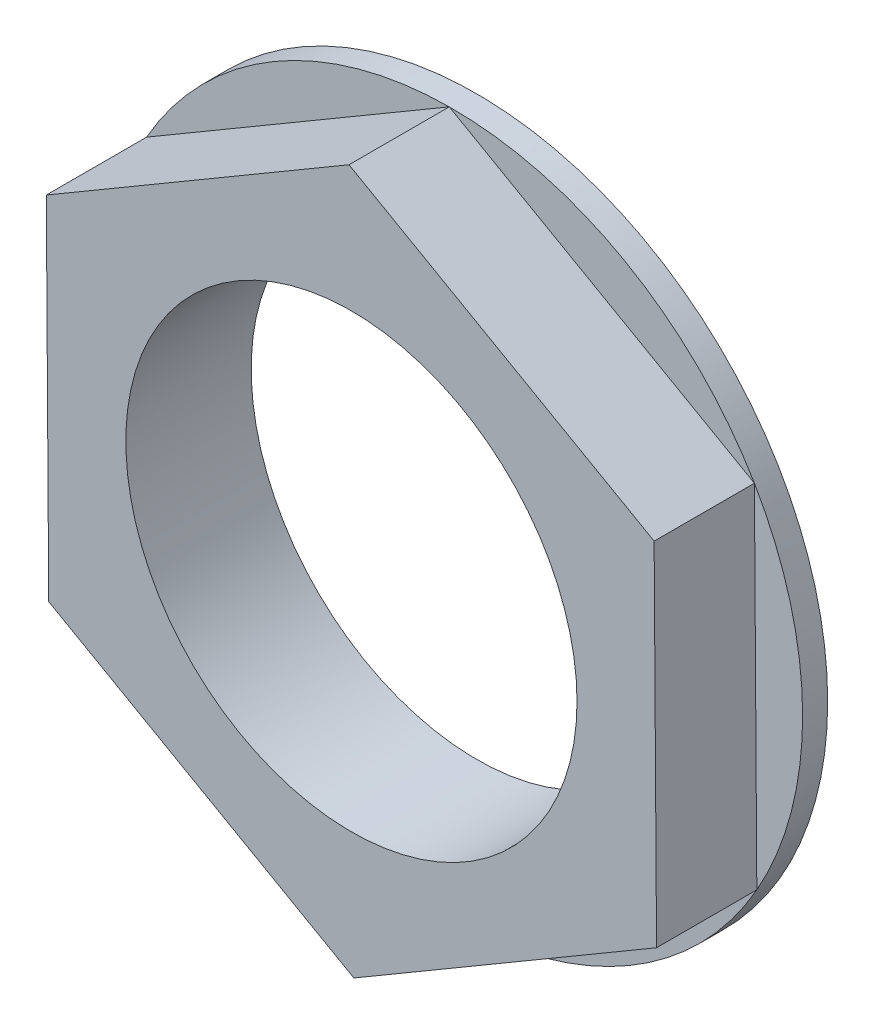
ISO-10303-21;
HEADER;
FILE_DESCRIPTION(('STEP AP214'),'2;1');
FILE_NAME('part.step','',(''),(''),'','','');
FILE_SCHEMA(('AUTOMOTIVE_DESIGN { 1 0 10303 214 1 1 1 1 }'));
ENDSEC;
DATA;
#1=APPLICATION_CONTEXT('core data for automotive mechanical design processes');
#2=APPLICATION_PROTOCOL_DEFINITION('international standard','automotive_design',2000,#1);
#3=PRODUCT_CONTEXT('',#1,'mechanical');
#4=PRODUCT('Part','Part','',(#3));
#5=PRODUCT_RELATED_PRODUCT_CATEGORY('part','',(#4));
#6=PRODUCT_DEFINITION_FORMATION('','',#4);
#7=PRODUCT_DEFINITION_CONTEXT('part definition',#1,'design');
#8=PRODUCT_DEFINITION('design','',#6,#7);
#9=PRODUCT_DEFINITION_SHAPE('','',#8);
#10=(LENGTH_UNIT() NAMED_UNIT(*) SI_UNIT(.MILLI.,.METRE.));
#11=(NAMED_UNIT(*) PLANE_ANGLE_UNIT() SI_UNIT($,.RADIAN.));
#12=(NAMED_UNIT(*) SI_UNIT($,.STERADIAN.) SOLID_ANGLE_UNIT());
#13=UNCERTAINTY_MEASURE_WITH_UNIT(LENGTH_MEASURE(1.E-05),#10,'distance_accuracy_value','');
#14=(GEOMETRIC_REPRESENTATION_CONTEXT(3) GLOBAL_UNCERTAINTY_ASSIGNED_CONTEXT((#13)) GLOBAL_UNIT_ASSIGNED_CONTEXT((#10,
#11,#12)) REPRESENTATION_CONTEXT('',''));
#15=CARTESIAN_POINT('',(0.,0.,0.));
#16=DIRECTION('',(0.,0.,1.));
#17=DIRECTION('',(1.,0.,0.));
#18=AXIS2_PLACEMENT_3D('',#15,#16,#17);
#19=CARTESIAN_POINT('',(0.,0.,0.5));
#20=DIRECTION('',(0.,0.,1.));
#21=DIRECTION('',(1.,0.,0.));
#22=AXIS2_PLACEMENT_3D('',#19,#20,#21);
#23=PLANE('',#22);
#24=DIRECTION('',(0.862546469794635,0.505977852721651,0.));
#25=VECTOR('',#24,1.);
#26=CARTESIAN_POINT('',(0.04841507518353,-6.99983256803296,0.5));
#27=LINE('',#26,#25);
#28=CARTESIAN_POINT('',(0.0484150751835391,-6.99983256803296,0.5));
#29=VERTEX_POINT('',#28);
#30=CARTESIAN_POINT('',(6.08624036374597,-3.45798759898142,0.5));
#31=VERTEX_POINT('',#30);
#32=EDGE_CURVE('E62',#29,#31,#27,.T.);
#33=ORIENTED_EDGE('',*,*,#32,.F.);
#34=CARTESIAN_POINT('',(0.,0.,0.5));
#35=DIRECTION('',(0.,0.,1.));
#36=DIRECTION('',(1.,0.,0.));
#37=AXIS2_PLACEMENT_3D('',#34,#35,#36);
#38=CIRCLE('',#37,7.);
#39=EDGE_CURVE('E217',#29,#31,#38,.T.);
#40=ORIENTED_EDGE('',*,*,#39,.T.);
#41=EDGE_LOOP('',(#33,#40));
#42=FACE_BOUND('',#41,.T.);
#43=ADVANCED_FACE('F39',(#42),#23,.T.);
#44=DIRECTION('',(0.869462909106568,-0.493998228425916,0.));
#45=VECTOR('',#44,1.);
#46=CARTESIAN_POINT('',(-6.03782528856244,-3.54184496905155,0.5));
#47=LINE('',#46,#45);
#48=CARTESIAN_POINT('',(-6.03782528856244,-3.54184496905156,0.5));
#49=VERTEX_POINT('',#48);
#50=EDGE_CURVE('E116',#49,#29,#47,.T.);
#51=ORIENTED_EDGE('',*,*,#50,.F.);
#52=EDGE_CURVE('E209',#49,#29,#38,.T.);
#53=ORIENTED_EDGE('',*,*,#52,.T.);
#54=EDGE_LOOP('',(#51,#53));
#55=FACE_BOUND('',#54,.T.);
#56=ADVANCED_FACE('F171',(#55),#23,.T.);
#57=DIRECTION('',(0.00691643931193311,-0.999976081147566,0.));
#58=VECTOR('',#57,1.);
#59=CARTESIAN_POINT('',(-6.08624036374597,3.45798759898141,0.5));
#60=LINE('',#59,#58);
#61=CARTESIAN_POINT('',(-6.08624036374598,3.4579875989814,0.5));
#62=VERTEX_POINT('',#61);
#63=EDGE_CURVE('E138',#62,#49,#60,.T.);
#64=ORIENTED_EDGE('',*,*,#63,.F.);
#65=EDGE_CURVE('E215',#62,#49,#38,.T.);
#66=ORIENTED_EDGE('',*,*,#65,.T.);
#67=EDGE_LOOP('',(#64,#66));
#68=FACE_BOUND('',#67,.T.);
#69=ADVANCED_FACE('F177',(#68),#23,.T.);
#70=DIRECTION('',(-0.862546469794635,-0.505977852721651,0.));
#71=VECTOR('',#70,1.);
#72=CARTESIAN_POINT('',(-0.04841507518353,6.99983256803296,0.5));
#73=LINE('',#72,#71);
#74=CARTESIAN_POINT('',(-0.048415075183536,6.99983256803296,0.5));
#75=VERTEX_POINT('',#74);
#76=EDGE_CURVE('E141',#75,#62,#73,.T.);
#77=ORIENTED_EDGE('',*,*,#76,.F.);
#78=EDGE_CURVE('E48',#75,#62,#38,.T.);
#79=ORIENTED_EDGE('',*,*,#78,.T.);
#80=EDGE_LOOP('',(#77,#79));
#81=FACE_BOUND('',#80,.T.);
#82=ADVANCED_FACE('F187',(#81),#23,.T.);
#83=DIRECTION('',(-0.869462909106568,0.493998228425916,0.));
#84=VECTOR('',#83,1.);
#85=CARTESIAN_POINT('',(6.03782528856244,3.54184496905156,0.5));
#86=LINE('',#85,#84);
#87=CARTESIAN_POINT('',(6.03782528856244,3.54184496905156,0.5));
#88=VERTEX_POINT('',#87);
#89=EDGE_CURVE('E144',#88,#75,#86,.T.);
#90=ORIENTED_EDGE('',*,*,#89,.F.);
#91=EDGE_CURVE('E11',#88,#75,#38,.T.);
#92=ORIENTED_EDGE('',*,*,#91,.T.);
#93=EDGE_LOOP('',(#90,#92));
#94=FACE_BOUND('',#93,.T.);
#95=ADVANCED_FACE('F181',(#94),#23,.T.);
#96=DIRECTION('',(-0.00691643931193311,0.999976081147567,0.));
#97=VECTOR('',#96,1.);
#98=CARTESIAN_POINT('',(6.08624036374597,-3.45798759898141,0.5));
#99=LINE('',#98,#97);
#100=EDGE_CURVE('E55',#31,#88,#99,.T.);
#101=ORIENTED_EDGE('',*,*,#100,.F.);
#102=EDGE_CURVE('E49',#31,#88,#38,.T.);
#103=ORIENTED_EDGE('',*,*,#102,.T.);
#104=EDGE_LOOP('',(#101,#103));
#105=FACE_BOUND('',#104,.T.);
#106=ADVANCED_FACE('F173',(#105),#23,.T.);
#107=CARTESIAN_POINT('',(0.,0.,0.));
#108=DIRECTION('',(0.,0.,1.));
#109=DIRECTION('',(1.,0.,0.));
#110=AXIS2_PLACEMENT_3D('',#107,#108,#109);
#111=PLANE('',#110);
#112=CARTESIAN_POINT('',(0.,0.,0.));
#113=DIRECTION('',(0.,0.,1.));
#114=DIRECTION('',(1.,0.,0.));
#115=AXIS2_PLACEMENT_3D('',#112,#113,#114);
#116=CIRCLE('',#115,7.);
#117=CARTESIAN_POINT('',(7.,0.,0.));
#118=VERTEX_POINT('',#117);
#119=EDGE_CURVE('E43',#118,#118,#116,.T.);
#120=ORIENTED_EDGE('',*,*,#119,.F.);
#121=EDGE_LOOP('',(#120));
#122=FACE_BOUND('',#121,.T.);
#123=CARTESIAN_POINT('',(0.,0.,0.));
#124=DIRECTION('',(0.,0.,1.));
#125=DIRECTION('',(1.,0.,0.));
#126=AXIS2_PLACEMENT_3D('',#123,#124,#125);
#127=CIRCLE('',#126,4.5);
#128=CARTESIAN_POINT('',(4.5,0.,0.));
#129=VERTEX_POINT('',#128);
#130=EDGE_CURVE('E119',#129,#129,#127,.T.);
#131=ORIENTED_EDGE('',*,*,#130,.T.);
#132=EDGE_LOOP('',(#131));
#133=FACE_BOUND('',#132,.T.);
#134=ADVANCED_FACE('F180',(#122,#133),#111,.F.);
#135=CARTESIAN_POINT('',(0.,0.,0.5));
#136=DIRECTION('',(0.,0.,-1.));
#137=DIRECTION('',(-1.,0.,0.));
#138=AXIS2_PLACEMENT_3D('',#135,#136,#137);
#139=CYLINDRICAL_SURFACE('',#138,7.);
#140=ORIENTED_EDGE('',*,*,#91,.F.);
#141=ORIENTED_EDGE('',*,*,#102,.F.);
#142=ORIENTED_EDGE('',*,*,#39,.F.);
#143=ORIENTED_EDGE('',*,*,#52,.F.);
#144=ORIENTED_EDGE('',*,*,#65,.F.);
#145=ORIENTED_EDGE('',*,*,#78,.F.);
#146=EDGE_LOOP('',(#140,#141,#142,#143,#144,#145));
#147=FACE_BOUND('',#146,.T.);
#148=ORIENTED_EDGE('',*,*,#119,.T.);
#149=EDGE_LOOP('',(#148));
#150=FACE_BOUND('',#149,.T.);
#151=ADVANCED_FACE('F41',(#147,#150),#139,.T.);
#152=CARTESIAN_POINT('',(0.,0.,0.5));
#153=DIRECTION('',(0.,0.,-1.));
#154=DIRECTION('',(-1.,0.,0.));
#155=AXIS2_PLACEMENT_3D('',#152,#153,#154);
#156=CYLINDRICAL_SURFACE('',#155,4.5);
#157=ORIENTED_EDGE('',*,*,#130,.F.);
#158=EDGE_LOOP('',(#157));
#159=FACE_BOUND('',#158,.T.);
#160=CARTESIAN_POINT('',(0.,0.,2.5));
#161=DIRECTION('',(0.,0.,1.));
#162=DIRECTION('',(1.,0.,0.));
#163=AXIS2_PLACEMENT_3D('',#160,#161,#162);
#164=CIRCLE('',#163,4.5);
#165=CARTESIAN_POINT('',(4.5,0.,2.5));
#166=VERTEX_POINT('',#165);
#167=EDGE_CURVE('E149',#166,#166,#164,.T.);
#168=ORIENTED_EDGE('',*,*,#167,.T.);
#169=EDGE_LOOP('',(#168));
#170=FACE_BOUND('',#169,.T.);
#171=ADVANCED_FACE('F159',(#159,#170),#156,.F.);
#172=CARTESIAN_POINT('',(0.,0.,2.5));
#173=DIRECTION('',(0.,0.,1.));
#174=DIRECTION('',(1.,0.,0.));
#175=AXIS2_PLACEMENT_3D('',#172,#173,#174);
#176=PLANE('',#175);
#177=DIRECTION('',(0.862546469794635,0.505977852721651,0.));
#178=VECTOR('',#177,1.);
#179=CARTESIAN_POINT('',(0.04841507518353,-6.99983256803296,2.5));
#180=LINE('',#179,#178);
#181=CARTESIAN_POINT('',(0.04841507518353,-6.99983256803296,2.5));
#182=VERTEX_POINT('',#181);
#183=CARTESIAN_POINT('',(6.08624036374597,-3.45798759898141,2.5));
#184=VERTEX_POINT('',#183);
#185=EDGE_CURVE('E106',#182,#184,#180,.T.);
#186=ORIENTED_EDGE('',*,*,#185,.T.);
#187=DIRECTION('',(-0.00691643931193311,0.999976081147567,0.));
#188=VECTOR('',#187,1.);
#189=CARTESIAN_POINT('',(6.08624036374597,-3.45798759898141,2.5));
#190=LINE('',#189,#188);
#191=CARTESIAN_POINT('',(6.03782528856244,3.54184496905156,2.5));
#192=VERTEX_POINT('',#191);
#193=EDGE_CURVE('E96',#184,#192,#190,.T.);
#194=ORIENTED_EDGE('',*,*,#193,.T.);
#195=DIRECTION('',(-0.869462909106568,0.493998228425916,0.));
#196=VECTOR('',#195,1.);
#197=CARTESIAN_POINT('',(6.03782528856244,3.54184496905156,2.5));
#198=LINE('',#197,#196);
#199=CARTESIAN_POINT('',(-0.04841507518353,6.99983256803296,2.5));
#200=VERTEX_POINT('',#199);
#201=EDGE_CURVE('E105',#192,#200,#198,.T.);
#202=ORIENTED_EDGE('',*,*,#201,.T.);
#203=DIRECTION('',(-0.862546469794635,-0.505977852721651,0.));
#204=VECTOR('',#203,1.);
#205=CARTESIAN_POINT('',(-0.04841507518353,6.99983256803296,2.5));
#206=LINE('',#205,#204);
#207=CARTESIAN_POINT('',(-6.08624036374597,3.45798759898141,2.5));
#208=VERTEX_POINT('',#207);
#209=EDGE_CURVE('E153',#200,#208,#206,.T.);
#210=ORIENTED_EDGE('',*,*,#209,.T.);
#211=DIRECTION('',(0.00691643931193311,-0.999976081147566,0.));
#212=VECTOR('',#211,1.);
#213=CARTESIAN_POINT('',(-6.08624036374597,3.45798759898141,2.5));
#214=LINE('',#213,#212);
#215=CARTESIAN_POINT('',(-6.03782528856244,-3.54184496905155,2.5));
#216=VERTEX_POINT('',#215);
#217=EDGE_CURVE('E151',#208,#216,#214,.T.);
#218=ORIENTED_EDGE('',*,*,#217,.T.);
#219=DIRECTION('',(0.869462909106568,-0.493998228425916,0.));
#220=VECTOR('',#219,1.);
#221=CARTESIAN_POINT('',(-6.03782528856244,-3.54184496905155,2.5));
#222=LINE('',#221,#220);
#223=EDGE_CURVE('E112',#216,#182,#222,.T.);
#224=ORIENTED_EDGE('',*,*,#223,.T.);
#225=EDGE_LOOP('',(#186,#194,#202,#210,#218,#224));
#226=FACE_BOUND('',#225,.T.);
#227=ORIENTED_EDGE('',*,*,#167,.F.);
#228=EDGE_LOOP('',(#227));
#229=FACE_BOUND('',#228,.T.);
#230=ADVANCED_FACE('F109',(#226,#229),#176,.T.);
#231=CARTESIAN_POINT('',(0.04841507518353,-6.99983256803296,2.5));
#232=DIRECTION('',(-0.505977852721651,0.862546469794635,0.));
#233=DIRECTION('',(-0.862546469794635,-0.505977852721651,0.));
#234=AXIS2_PLACEMENT_3D('',#231,#232,#233);
#235=PLANE('',#234);
#236=ORIENTED_EDGE('',*,*,#32,.T.);
#237=DIRECTION('',(0.,0.,-1.));
#238=VECTOR('',#237,1.);
#239=CARTESIAN_POINT('',(6.08624036374597,-3.45798759898141,2.5));
#240=LINE('',#239,#238);
#241=EDGE_CURVE('E100',#184,#31,#240,.T.);
#242=ORIENTED_EDGE('',*,*,#241,.F.);
#243=ORIENTED_EDGE('',*,*,#185,.F.);
#244=DIRECTION('',(0.,0.,-1.));
#245=VECTOR('',#244,1.);
#246=CARTESIAN_POINT('',(0.04841507518353,-6.99983256803296,2.5));
#247=LINE('',#246,#245);
#248=EDGE_CURVE('E134',#182,#29,#247,.T.);
#249=ORIENTED_EDGE('',*,*,#248,.T.);
#250=EDGE_LOOP('',(#236,#242,#243,#249));
#251=FACE_BOUND('',#250,.T.);
#252=ADVANCED_FACE('F118',(#251),#235,.F.);
#253=CARTESIAN_POINT('',(6.08624036374597,-3.45798759898141,2.5));
#254=DIRECTION('',(-0.999976081147566,-0.0069164393119331,0.));
#255=DIRECTION('',(0.0069164393119331,-0.999976081147566,0.));
#256=AXIS2_PLACEMENT_3D('',#253,#254,#255);
#257=PLANE('',#256);
#258=ORIENTED_EDGE('',*,*,#100,.T.);
#259=DIRECTION('',(0.,0.,-1.));
#260=VECTOR('',#259,1.);
#261=CARTESIAN_POINT('',(6.03782528856244,3.54184496905156,2.5));
#262=LINE('',#261,#260);
#263=EDGE_CURVE('E102',#192,#88,#262,.T.);
#264=ORIENTED_EDGE('',*,*,#263,.F.);
#265=ORIENTED_EDGE('',*,*,#193,.F.);
#266=ORIENTED_EDGE('',*,*,#241,.T.);
#267=EDGE_LOOP('',(#258,#264,#265,#266));
#268=FACE_BOUND('',#267,.T.);
#269=ADVANCED_FACE('F98',(#268),#257,.F.);
#270=CARTESIAN_POINT('',(6.03782528856244,3.54184496905156,2.5));
#271=DIRECTION('',(-0.493998228425916,-0.869462909106568,0.));
#272=DIRECTION('',(0.869462909106568,-0.493998228425916,0.));
#273=AXIS2_PLACEMENT_3D('',#270,#271,#272);
#274=PLANE('',#273);
#275=ORIENTED_EDGE('',*,*,#89,.T.);
#276=DIRECTION('',(0.,0.,-1.));
#277=VECTOR('',#276,1.);
#278=CARTESIAN_POINT('',(-0.04841507518353,6.99983256803296,2.5));
#279=LINE('',#278,#277);
#280=EDGE_CURVE('E123',#200,#75,#279,.T.);
#281=ORIENTED_EDGE('',*,*,#280,.F.);
#282=ORIENTED_EDGE('',*,*,#201,.F.);
#283=ORIENTED_EDGE('',*,*,#263,.T.);
#284=EDGE_LOOP('',(#275,#281,#282,#283));
#285=FACE_BOUND('',#284,.T.);
#286=ADVANCED_FACE('F196',(#285),#274,.F.);
#287=CARTESIAN_POINT('',(-0.04841507518353,6.99983256803296,2.5));
#288=DIRECTION('',(0.505977852721651,-0.862546469794635,0.));
#289=DIRECTION('',(0.862546469794635,0.505977852721651,0.));
#290=AXIS2_PLACEMENT_3D('',#287,#288,#289);
#291=PLANE('',#290);
#292=ORIENTED_EDGE('',*,*,#76,.T.);
#293=DIRECTION('',(0.,0.,-1.));
#294=VECTOR('',#293,1.);
#295=CARTESIAN_POINT('',(-6.08624036374597,3.45798759898141,2.5));
#296=LINE('',#295,#294);
#297=EDGE_CURVE('E128',#208,#62,#296,.T.);
#298=ORIENTED_EDGE('',*,*,#297,.F.);
#299=ORIENTED_EDGE('',*,*,#209,.F.);
#300=ORIENTED_EDGE('',*,*,#280,.T.);
#301=EDGE_LOOP('',(#292,#298,#299,#300));
#302=FACE_BOUND('',#301,.T.);
#303=ADVANCED_FACE('F202',(#302),#291,.F.);
#304=CARTESIAN_POINT('',(-6.08624036374597,3.45798759898141,2.5));
#305=DIRECTION('',(0.999976081147566,0.00691643931193311,0.));
#306=DIRECTION('',(-0.00691643931193311,0.999976081147566,0.));
#307=AXIS2_PLACEMENT_3D('',#304,#305,#306);
#308=PLANE('',#307);
#309=ORIENTED_EDGE('',*,*,#63,.T.);
#310=DIRECTION('',(0.,0.,-1.));
#311=VECTOR('',#310,1.);
#312=CARTESIAN_POINT('',(-6.03782528856244,-3.54184496905155,2.5));
#313=LINE('',#312,#311);
#314=EDGE_CURVE('E131',#216,#49,#313,.T.);
#315=ORIENTED_EDGE('',*,*,#314,.F.);
#316=ORIENTED_EDGE('',*,*,#217,.F.);
#317=ORIENTED_EDGE('',*,*,#297,.T.);
#318=EDGE_LOOP('',(#309,#315,#316,#317));
#319=FACE_BOUND('',#318,.T.);
#320=ADVANCED_FACE('F204',(#319),#308,.F.);
#321=CARTESIAN_POINT('',(-6.03782528856244,-3.54184496905155,2.5));
#322=DIRECTION('',(0.493998228425916,0.869462909106568,0.));
#323=DIRECTION('',(-0.869462909106568,0.493998228425916,0.));
#324=AXIS2_PLACEMENT_3D('',#321,#322,#323);
#325=PLANE('',#324);
#326=ORIENTED_EDGE('',*,*,#50,.T.);
#327=ORIENTED_EDGE('',*,*,#248,.F.);
#328=ORIENTED_EDGE('',*,*,#223,.F.);
#329=ORIENTED_EDGE('',*,*,#314,.T.);
#330=EDGE_LOOP('',(#326,#327,#328,#329));
#331=FACE_BOUND('',#330,.T.);
#332=ADVANCED_FACE('F206',(#331),#325,.F.);
#333=CLOSED_SHELL('',(#43,#56,#69,#82,#95,#106,#134,#151,#171,#230,#252,#269,#286,#303,#320,#332));
#334=MANIFOLD_SOLID_BREP('B2',#333);
#335=ADVANCED_BREP_SHAPE_REPRESENTATION('',(#18,#334),#14);
#336=SHAPE_DEFINITION_REPRESENTATION(#9,#335);
ENDSEC;
END-ISO-10303-21;
